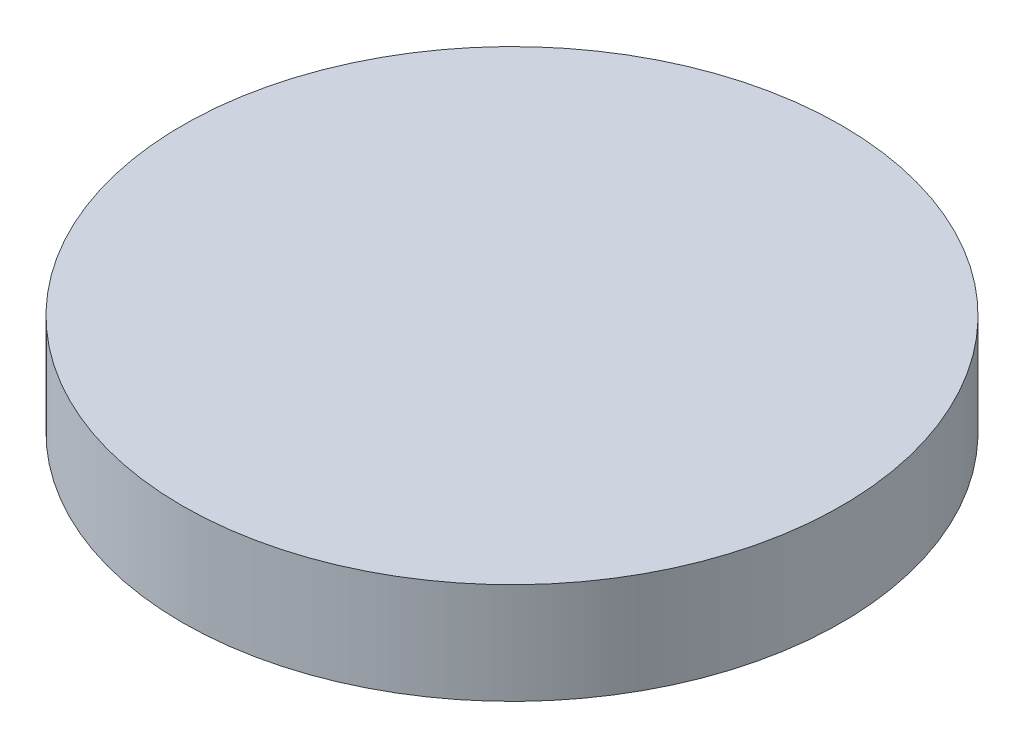
ISO-10303-21;
HEADER;
FILE_DESCRIPTION(('STEP AP214'),'2;1');
FILE_NAME('part.step','',(''),(''),'','','');
FILE_SCHEMA(('AUTOMOTIVE_DESIGN { 1 0 10303 214 1 1 1 1 }'));
ENDSEC;
DATA;
#1=APPLICATION_CONTEXT('core data for automotive mechanical design processes');
#2=APPLICATION_PROTOCOL_DEFINITION('international standard','automotive_design',2000,#1);
#3=PRODUCT_CONTEXT('',#1,'mechanical');
#4=PRODUCT('Part','Part','',(#3));
#5=PRODUCT_RELATED_PRODUCT_CATEGORY('part','',(#4));
#6=PRODUCT_DEFINITION_FORMATION('','',#4);
#7=PRODUCT_DEFINITION_CONTEXT('part definition',#1,'design');
#8=PRODUCT_DEFINITION('design','',#6,#7);
#9=PRODUCT_DEFINITION_SHAPE('','',#8);
#10=(LENGTH_UNIT() NAMED_UNIT(*) SI_UNIT(.MILLI.,.METRE.));
#11=(NAMED_UNIT(*) PLANE_ANGLE_UNIT() SI_UNIT($,.RADIAN.));
#12=(NAMED_UNIT(*) SI_UNIT($,.STERADIAN.) SOLID_ANGLE_UNIT());
#13=UNCERTAINTY_MEASURE_WITH_UNIT(LENGTH_MEASURE(1.E-05),#10,'distance_accuracy_value','');
#14=(GEOMETRIC_REPRESENTATION_CONTEXT(3) GLOBAL_UNCERTAINTY_ASSIGNED_CONTEXT((#13)) GLOBAL_UNIT_ASSIGNED_CONTEXT((#10,
#11,#12)) REPRESENTATION_CONTEXT('',''));
#15=CARTESIAN_POINT('',(0.,0.,0.));
#16=DIRECTION('',(0.,0.,1.));
#17=DIRECTION('',(1.,0.,0.));
#18=AXIS2_PLACEMENT_3D('',#15,#16,#17);
#19=CARTESIAN_POINT('',(0.,1.,0.));
#20=DIRECTION('',(0.,-1.,0.));
#21=DIRECTION('',(0.,0.,-1.));
#22=AXIS2_PLACEMENT_3D('',#19,#20,#21);
#23=CYLINDRICAL_SURFACE('',#22,3.26057443);
#24=CARTESIAN_POINT('',(0.,1.,0.));
#25=DIRECTION('',(0.,1.,0.));
#26=DIRECTION('',(0.,0.,1.));
#27=AXIS2_PLACEMENT_3D('',#24,#25,#26);
#28=CIRCLE('',#27,3.26057443);
#29=CARTESIAN_POINT('',(0.,1.,3.26057443));
#30=VERTEX_POINT('',#29);
#31=EDGE_CURVE('E10',#30,#30,#28,.T.);
#32=ORIENTED_EDGE('',*,*,#31,.F.);
#33=EDGE_LOOP('',(#32));
#34=FACE_BOUND('',#33,.T.);
#35=CARTESIAN_POINT('',(0.,0.,0.));
#36=DIRECTION('',(0.,1.,0.));
#37=DIRECTION('',(0.,0.,1.));
#38=AXIS2_PLACEMENT_3D('',#35,#36,#37);
#39=CIRCLE('',#38,3.26057443);
#40=CARTESIAN_POINT('',(0.,0.,3.26057443));
#41=VERTEX_POINT('',#40);
#42=EDGE_CURVE('E40',#41,#41,#39,.T.);
#43=ORIENTED_EDGE('',*,*,#42,.T.);
#44=EDGE_LOOP('',(#43));
#45=FACE_BOUND('',#44,.T.);
#46=ADVANCED_FACE('F37',(#34,#45),#23,.T.);
#47=CARTESIAN_POINT('',(0.,1.,0.));
#48=DIRECTION('',(0.,1.,0.));
#49=DIRECTION('',(0.,0.,1.));
#50=AXIS2_PLACEMENT_3D('',#47,#48,#49);
#51=PLANE('',#50);
#52=ORIENTED_EDGE('',*,*,#31,.T.);
#53=EDGE_LOOP('',(#52));
#54=FACE_BOUND('',#53,.T.);
#55=ADVANCED_FACE('F54',(#54),#51,.T.);
#56=CARTESIAN_POINT('',(0.,0.,0.));
#57=DIRECTION('',(0.,1.,0.));
#58=DIRECTION('',(0.,0.,1.));
#59=AXIS2_PLACEMENT_3D('',#56,#57,#58);
#60=PLANE('',#59);
#61=ORIENTED_EDGE('',*,*,#42,.F.);
#62=EDGE_LOOP('',(#61));
#63=FACE_BOUND('',#62,.T.);
#64=ADVANCED_FACE('F52',(#63),#60,.F.);
#65=CLOSED_SHELL('',(#46,#55,#64));
#66=MANIFOLD_SOLID_BREP('B2',#65);
#67=ADVANCED_BREP_SHAPE_REPRESENTATION('',(#18,#66),#14);
#68=SHAPE_DEFINITION_REPRESENTATION(#9,#67);
ENDSEC;
END-ISO-10303-21;
